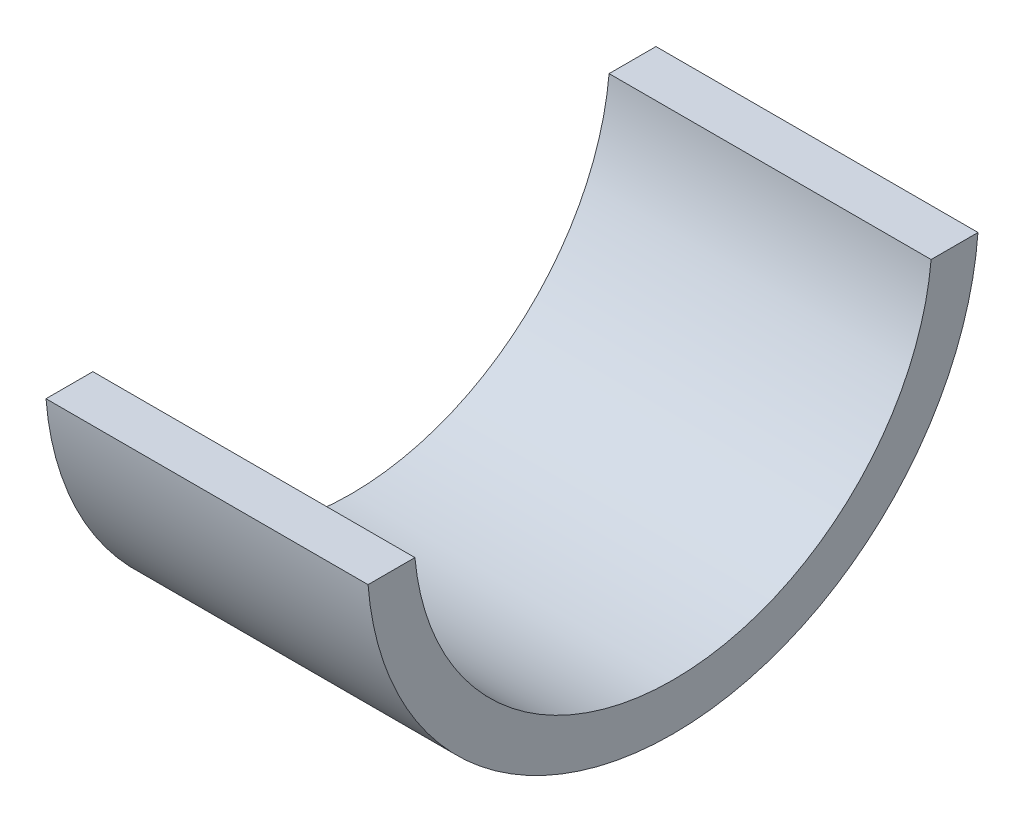
ISO-10303-21;
HEADER;
FILE_DESCRIPTION(('STEP AP214'),'2;1');
FILE_NAME('part.step','',(''),(''),'','','');
FILE_SCHEMA(('AUTOMOTIVE_DESIGN { 1 0 10303 214 1 1 1 1 }'));
ENDSEC;
DATA;
#1=APPLICATION_CONTEXT('core data for automotive mechanical design processes');
#2=APPLICATION_PROTOCOL_DEFINITION('international standard','automotive_design',2000,#1);
#3=PRODUCT_CONTEXT('',#1,'mechanical');
#4=PRODUCT('Part','Part','',(#3));
#5=PRODUCT_RELATED_PRODUCT_CATEGORY('part','',(#4));
#6=PRODUCT_DEFINITION_FORMATION('','',#4);
#7=PRODUCT_DEFINITION_CONTEXT('part definition',#1,'design');
#8=PRODUCT_DEFINITION('design','',#6,#7);
#9=PRODUCT_DEFINITION_SHAPE('','',#8);
#10=(LENGTH_UNIT() NAMED_UNIT(*) SI_UNIT(.MILLI.,.METRE.));
#11=(NAMED_UNIT(*) PLANE_ANGLE_UNIT() SI_UNIT($,.RADIAN.));
#12=(NAMED_UNIT(*) SI_UNIT($,.STERADIAN.) SOLID_ANGLE_UNIT());
#13=UNCERTAINTY_MEASURE_WITH_UNIT(LENGTH_MEASURE(1.E-05),#10,'distance_accuracy_value','');
#14=(GEOMETRIC_REPRESENTATION_CONTEXT(3) GLOBAL_UNCERTAINTY_ASSIGNED_CONTEXT((#13)) GLOBAL_UNIT_ASSIGNED_CONTEXT((#10,
#11,#12)) REPRESENTATION_CONTEXT('',''));
#15=CARTESIAN_POINT('',(0.,0.,0.));
#16=DIRECTION('',(0.,0.,1.));
#17=DIRECTION('',(1.,0.,0.));
#18=AXIS2_PLACEMENT_3D('',#15,#16,#17);
#19=CARTESIAN_POINT('',(25.4,0.,0.));
#20=DIRECTION('',(-1.,0.,0.));
#21=DIRECTION('',(0.,0.,1.));
#22=AXIS2_PLACEMENT_3D('',#19,#20,#21);
#23=CYLINDRICAL_SURFACE('',#22,24.13);
#24=CARTESIAN_POINT('',(0.,0.,0.));
#25=DIRECTION('',(1.,0.,0.));
#26=DIRECTION('',(0.,0.,-1.));
#27=AXIS2_PLACEMENT_3D('',#24,#25,#26);
#28=CIRCLE('',#27,24.13);
#29=CARTESIAN_POINT('',(0.,-1.905,24.0546850945923));
#30=VERTEX_POINT('',#29);
#31=CARTESIAN_POINT('',(0.,-1.905,-24.0546850945923));
#32=VERTEX_POINT('',#31);
#33=EDGE_CURVE('E96',#30,#32,#28,.T.);
#34=ORIENTED_EDGE('',*,*,#33,.T.);
#35=DIRECTION('',(-1.,0.,0.));
#36=VECTOR('',#35,1.);
#37=CARTESIAN_POINT('',(25.4,-1.905,-24.0546850945923));
#38=LINE('',#37,#36);
#39=CARTESIAN_POINT('',(25.4,-1.905,-24.0546850945923));
#40=VERTEX_POINT('',#39);
#41=EDGE_CURVE('E11',#40,#32,#38,.T.);
#42=ORIENTED_EDGE('',*,*,#41,.F.);
#43=CARTESIAN_POINT('',(25.4,0.,0.));
#44=DIRECTION('',(1.,0.,0.));
#45=DIRECTION('',(0.,0.,-1.));
#46=AXIS2_PLACEMENT_3D('',#43,#44,#45);
#47=CIRCLE('',#46,24.13);
#48=CARTESIAN_POINT('',(25.4,-1.905,24.0546850945923));
#49=VERTEX_POINT('',#48);
#50=EDGE_CURVE('E84',#49,#40,#47,.T.);
#51=ORIENTED_EDGE('',*,*,#50,.F.);
#52=DIRECTION('',(-1.,0.,0.));
#53=VECTOR('',#52,1.);
#54=CARTESIAN_POINT('',(25.4,-1.905,24.0546850945923));
#55=LINE('',#54,#53);
#56=EDGE_CURVE('E92',#49,#30,#55,.T.);
#57=ORIENTED_EDGE('',*,*,#56,.T.);
#58=EDGE_LOOP('',(#34,#42,#51,#57));
#59=FACE_BOUND('',#58,.T.);
#60=ADVANCED_FACE('F33',(#59),#23,.T.);
#61=CARTESIAN_POINT('',(25.4,-1.905,-20.3580643480661));
#62=DIRECTION('',(0.,-1.,0.));
#63=DIRECTION('',(0.,0.,-1.));
#64=AXIS2_PLACEMENT_3D('',#61,#62,#63);
#65=PLANE('',#64);
#66=DIRECTION('',(0.,0.,1.));
#67=VECTOR('',#66,1.);
#68=CARTESIAN_POINT('',(0.,-1.905,-20.3580643480661));
#69=LINE('',#68,#67);
#70=CARTESIAN_POINT('',(0.,-1.905,-20.3580643480661));
#71=VERTEX_POINT('',#70);
#72=EDGE_CURVE('E88',#32,#71,#69,.T.);
#73=ORIENTED_EDGE('',*,*,#72,.T.);
#74=DIRECTION('',(-1.,0.,0.));
#75=VECTOR('',#74,1.);
#76=CARTESIAN_POINT('',(25.4,-1.905,-20.3580643480661));
#77=LINE('',#76,#75);
#78=CARTESIAN_POINT('',(25.4,-1.905,-20.3580643480661));
#79=VERTEX_POINT('',#78);
#80=EDGE_CURVE('E41',#79,#71,#77,.T.);
#81=ORIENTED_EDGE('',*,*,#80,.F.);
#82=DIRECTION('',(0.,0.,1.));
#83=VECTOR('',#82,1.);
#84=CARTESIAN_POINT('',(25.4,-1.905,-20.3580643480661));
#85=LINE('',#84,#83);
#86=EDGE_CURVE('E79',#40,#79,#85,.T.);
#87=ORIENTED_EDGE('',*,*,#86,.F.);
#88=ORIENTED_EDGE('',*,*,#41,.T.);
#89=EDGE_LOOP('',(#73,#81,#87,#88));
#90=FACE_BOUND('',#89,.T.);
#91=ADVANCED_FACE('F87',(#90),#65,.F.);
#92=CARTESIAN_POINT('',(25.4,0.,0.));
#93=DIRECTION('',(-1.,0.,0.));
#94=DIRECTION('',(0.,0.,1.));
#95=AXIS2_PLACEMENT_3D('',#92,#93,#94);
#96=CYLINDRICAL_SURFACE('',#95,20.447);
#97=CARTESIAN_POINT('',(0.,0.,0.));
#98=DIRECTION('',(-1.,0.,0.));
#99=DIRECTION('',(0.,0.,-1.));
#100=AXIS2_PLACEMENT_3D('',#97,#98,#99);
#101=CIRCLE('',#100,20.447);
#102=CARTESIAN_POINT('',(0.,-1.905,20.3580643480661));
#103=VERTEX_POINT('',#102);
#104=EDGE_CURVE('E66',#71,#103,#101,.T.);
#105=ORIENTED_EDGE('',*,*,#104,.T.);
#106=DIRECTION('',(-1.,0.,0.));
#107=VECTOR('',#106,1.);
#108=CARTESIAN_POINT('',(25.4,-1.905,20.3580643480661));
#109=LINE('',#108,#107);
#110=CARTESIAN_POINT('',(25.4,-1.905,20.3580643480661));
#111=VERTEX_POINT('',#110);
#112=EDGE_CURVE('E89',#111,#103,#109,.T.);
#113=ORIENTED_EDGE('',*,*,#112,.F.);
#114=CARTESIAN_POINT('',(25.4,0.,0.));
#115=DIRECTION('',(-1.,0.,0.));
#116=DIRECTION('',(0.,0.,-1.));
#117=AXIS2_PLACEMENT_3D('',#114,#115,#116);
#118=CIRCLE('',#117,20.447);
#119=EDGE_CURVE('E82',#79,#111,#118,.T.);
#120=ORIENTED_EDGE('',*,*,#119,.F.);
#121=ORIENTED_EDGE('',*,*,#80,.T.);
#122=EDGE_LOOP('',(#105,#113,#120,#121));
#123=FACE_BOUND('',#122,.T.);
#124=ADVANCED_FACE('F90',(#123),#96,.F.);
#125=CARTESIAN_POINT('',(25.4,-1.905,24.0546850945923));
#126=DIRECTION('',(0.,-1.,0.));
#127=DIRECTION('',(0.,0.,-1.));
#128=AXIS2_PLACEMENT_3D('',#125,#126,#127);
#129=PLANE('',#128);
#130=DIRECTION('',(0.,0.,1.));
#131=VECTOR('',#130,1.);
#132=CARTESIAN_POINT('',(0.,-1.905,24.0546850945923));
#133=LINE('',#132,#131);
#134=EDGE_CURVE('E72',#103,#30,#133,.T.);
#135=ORIENTED_EDGE('',*,*,#134,.T.);
#136=ORIENTED_EDGE('',*,*,#56,.F.);
#137=DIRECTION('',(0.,0.,1.));
#138=VECTOR('',#137,1.);
#139=CARTESIAN_POINT('',(25.4,-1.905,24.0546850945923));
#140=LINE('',#139,#138);
#141=EDGE_CURVE('E49',#111,#49,#140,.T.);
#142=ORIENTED_EDGE('',*,*,#141,.F.);
#143=ORIENTED_EDGE('',*,*,#112,.T.);
#144=EDGE_LOOP('',(#135,#136,#142,#143));
#145=FACE_BOUND('',#144,.T.);
#146=ADVANCED_FACE('F103',(#145),#129,.F.);
#147=CARTESIAN_POINT('',(25.4,0.,0.));
#148=DIRECTION('',(1.,0.,0.));
#149=DIRECTION('',(0.,0.,-1.));
#150=AXIS2_PLACEMENT_3D('',#147,#148,#149);
#151=PLANE('',#150);
#152=ORIENTED_EDGE('',*,*,#50,.T.);
#153=ORIENTED_EDGE('',*,*,#86,.T.);
#154=ORIENTED_EDGE('',*,*,#119,.T.);
#155=ORIENTED_EDGE('',*,*,#141,.T.);
#156=EDGE_LOOP('',(#152,#153,#154,#155));
#157=FACE_BOUND('',#156,.T.);
#158=ADVANCED_FACE('F80',(#157),#151,.T.);
#159=CARTESIAN_POINT('',(0.,0.,0.));
#160=DIRECTION('',(1.,0.,0.));
#161=DIRECTION('',(0.,0.,-1.));
#162=AXIS2_PLACEMENT_3D('',#159,#160,#161);
#163=PLANE('',#162);
#164=ORIENTED_EDGE('',*,*,#33,.F.);
#165=ORIENTED_EDGE('',*,*,#134,.F.);
#166=ORIENTED_EDGE('',*,*,#104,.F.);
#167=ORIENTED_EDGE('',*,*,#72,.F.);
#168=EDGE_LOOP('',(#164,#165,#166,#167));
#169=FACE_BOUND('',#168,.T.);
#170=ADVANCED_FACE('F106',(#169),#163,.F.);
#171=CLOSED_SHELL('',(#60,#91,#124,#146,#158,#170));
#172=MANIFOLD_SOLID_BREP('B2',#171);
#173=ADVANCED_BREP_SHAPE_REPRESENTATION('',(#18,#172),#14);
#174=SHAPE_DEFINITION_REPRESENTATION(#9,#173);
ENDSEC;
END-ISO-10303-21;
